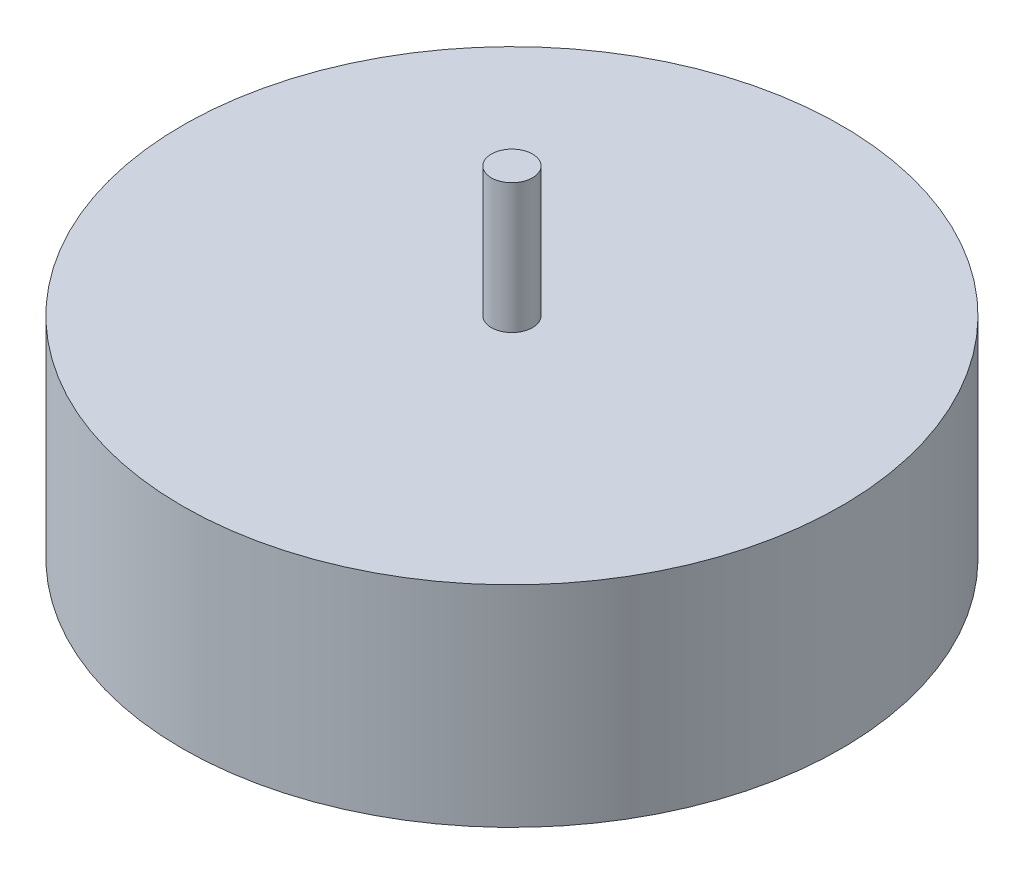
ISO-10303-21;
HEADER;
FILE_DESCRIPTION(('STEP AP214'),'2;1');
FILE_NAME('part.step','',(''),(''),'','','');
FILE_SCHEMA(('AUTOMOTIVE_DESIGN { 1 0 10303 214 1 1 1 1 }'));
ENDSEC;
DATA;
#1=APPLICATION_CONTEXT('core data for automotive mechanical design processes');
#2=APPLICATION_PROTOCOL_DEFINITION('international standard','automotive_design',2000,#1);
#3=PRODUCT_CONTEXT('',#1,'mechanical');
#4=PRODUCT('Part','Part','',(#3));
#5=PRODUCT_RELATED_PRODUCT_CATEGORY('part','',(#4));
#6=PRODUCT_DEFINITION_FORMATION('','',#4);
#7=PRODUCT_DEFINITION_CONTEXT('part definition',#1,'design');
#8=PRODUCT_DEFINITION('design','',#6,#7);
#9=PRODUCT_DEFINITION_SHAPE('','',#8);
#10=(LENGTH_UNIT() NAMED_UNIT(*) SI_UNIT(.MILLI.,.METRE.));
#11=(NAMED_UNIT(*) PLANE_ANGLE_UNIT() SI_UNIT($,.RADIAN.));
#12=(NAMED_UNIT(*) SI_UNIT($,.STERADIAN.) SOLID_ANGLE_UNIT());
#13=UNCERTAINTY_MEASURE_WITH_UNIT(LENGTH_MEASURE(1.E-05),#10,'distance_accuracy_value','');
#14=(GEOMETRIC_REPRESENTATION_CONTEXT(3) GLOBAL_UNCERTAINTY_ASSIGNED_CONTEXT((#13)) GLOBAL_UNIT_ASSIGNED_CONTEXT((#10,
#11,#12)) REPRESENTATION_CONTEXT('',''));
#15=CARTESIAN_POINT('',(0.,0.,0.));
#16=DIRECTION('',(0.,0.,1.));
#17=DIRECTION('',(1.,0.,0.));
#18=AXIS2_PLACEMENT_3D('',#15,#16,#17);
#19=CARTESIAN_POINT('',(0.,80.96,0.));
#20=DIRECTION('',(0.,-1.,0.));
#21=DIRECTION('',(0.,0.,-1.));
#22=AXIS2_PLACEMENT_3D('',#19,#20,#21);
#23=CYLINDRICAL_SURFACE('',#22,127.);
#24=CARTESIAN_POINT('',(0.,80.96,0.));
#25=DIRECTION('',(0.,1.,0.));
#26=DIRECTION('',(0.,0.,1.));
#27=AXIS2_PLACEMENT_3D('',#24,#25,#26);
#28=CIRCLE('',#27,127.);
#29=CARTESIAN_POINT('',(0.,80.96,127.));
#30=VERTEX_POINT('',#29);
#31=EDGE_CURVE('E10',#30,#30,#28,.T.);
#32=ORIENTED_EDGE('',*,*,#31,.F.);
#33=EDGE_LOOP('',(#32));
#34=FACE_BOUND('',#33,.T.);
#35=CARTESIAN_POINT('',(0.,0.,0.));
#36=DIRECTION('',(0.,1.,0.));
#37=DIRECTION('',(0.,0.,1.));
#38=AXIS2_PLACEMENT_3D('',#35,#36,#37);
#39=CIRCLE('',#38,127.);
#40=CARTESIAN_POINT('',(0.,0.,127.));
#41=VERTEX_POINT('',#40);
#42=EDGE_CURVE('E46',#41,#41,#39,.T.);
#43=ORIENTED_EDGE('',*,*,#42,.T.);
#44=EDGE_LOOP('',(#43));
#45=FACE_BOUND('',#44,.T.);
#46=ADVANCED_FACE('F43',(#34,#45),#23,.T.);
#47=CARTESIAN_POINT('',(0.,80.96,0.));
#48=DIRECTION('',(0.,1.,0.));
#49=DIRECTION('',(0.,0.,1.));
#50=AXIS2_PLACEMENT_3D('',#47,#48,#49);
#51=PLANE('',#50);
#52=CARTESIAN_POINT('',(0.,80.96,0.));
#53=DIRECTION('',(0.,1.,0.));
#54=DIRECTION('',(0.,0.,1.));
#55=AXIS2_PLACEMENT_3D('',#52,#53,#54);
#56=CIRCLE('',#55,7.9375);
#57=CARTESIAN_POINT('',(0.,80.96,7.9375));
#58=VERTEX_POINT('',#57);
#59=EDGE_CURVE('E57',#58,#58,#56,.T.);
#60=ORIENTED_EDGE('',*,*,#59,.F.);
#61=EDGE_LOOP('',(#60));
#62=FACE_BOUND('',#61,.T.);
#63=ORIENTED_EDGE('',*,*,#31,.T.);
#64=EDGE_LOOP('',(#63));
#65=FACE_BOUND('',#64,.T.);
#66=ADVANCED_FACE('F74',(#62,#65),#51,.T.);
#67=CARTESIAN_POINT('',(0.,0.,0.));
#68=DIRECTION('',(0.,1.,0.));
#69=DIRECTION('',(0.,0.,1.));
#70=AXIS2_PLACEMENT_3D('',#67,#68,#69);
#71=PLANE('',#70);
#72=ORIENTED_EDGE('',*,*,#42,.F.);
#73=EDGE_LOOP('',(#72));
#74=FACE_BOUND('',#73,.T.);
#75=ADVANCED_FACE('F70',(#74),#71,.F.);
#76=CARTESIAN_POINT('',(0.,130.96,0.));
#77=DIRECTION('',(0.,-1.,0.));
#78=DIRECTION('',(0.,0.,-1.));
#79=AXIS2_PLACEMENT_3D('',#76,#77,#78);
#80=CYLINDRICAL_SURFACE('',#79,7.9375);
#81=CARTESIAN_POINT('',(0.,130.96,0.));
#82=DIRECTION('',(0.,1.,0.));
#83=DIRECTION('',(0.,0.,1.));
#84=AXIS2_PLACEMENT_3D('',#81,#82,#83);
#85=CIRCLE('',#84,7.9375);
#86=CARTESIAN_POINT('',(0.,130.96,7.9375));
#87=VERTEX_POINT('',#86);
#88=EDGE_CURVE('E55',#87,#87,#85,.T.);
#89=ORIENTED_EDGE('',*,*,#88,.F.);
#90=EDGE_LOOP('',(#89));
#91=FACE_BOUND('',#90,.T.);
#92=ORIENTED_EDGE('',*,*,#59,.T.);
#93=EDGE_LOOP('',(#92));
#94=FACE_BOUND('',#93,.T.);
#95=ADVANCED_FACE('F67',(#91,#94),#80,.T.);
#96=CARTESIAN_POINT('',(0.,130.96,0.));
#97=DIRECTION('',(0.,1.,0.));
#98=DIRECTION('',(0.,0.,1.));
#99=AXIS2_PLACEMENT_3D('',#96,#97,#98);
#100=PLANE('',#99);
#101=ORIENTED_EDGE('',*,*,#88,.T.);
#102=EDGE_LOOP('',(#101));
#103=FACE_BOUND('',#102,.T.);
#104=ADVANCED_FACE('F65',(#103),#100,.T.);
#105=CLOSED_SHELL('',(#46,#66,#75,#95,#104));
#106=MANIFOLD_SOLID_BREP('B2',#105);
#107=ADVANCED_BREP_SHAPE_REPRESENTATION('',(#18,#106),#14);
#108=SHAPE_DEFINITION_REPRESENTATION(#9,#107);
ENDSEC;
END-ISO-10303-21;
